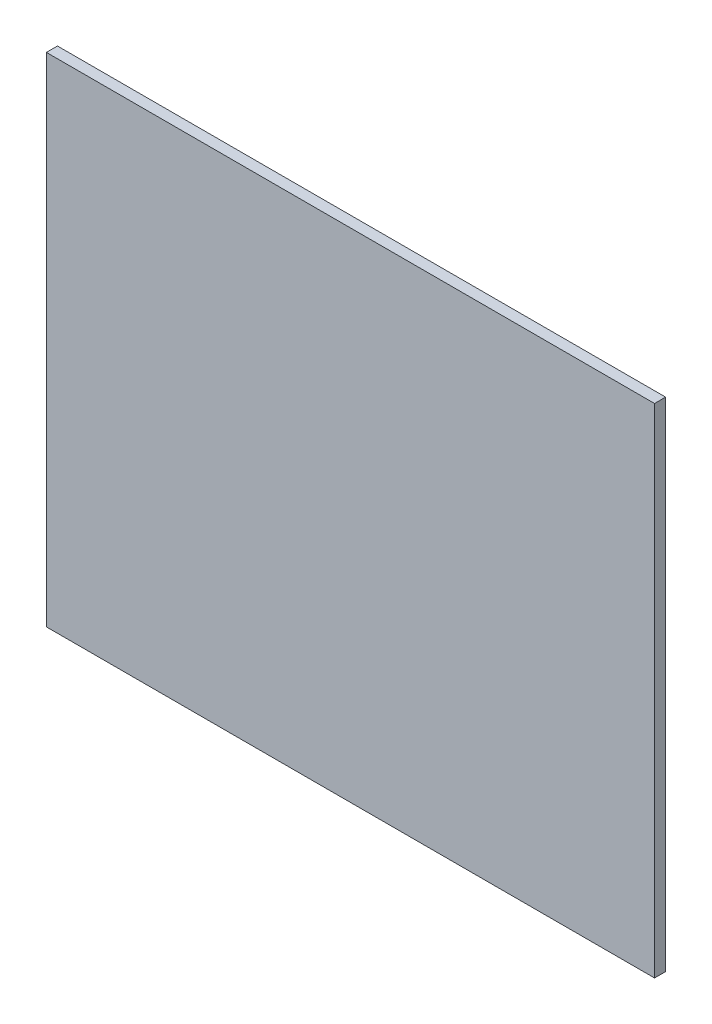
ISO-10303-21;
HEADER;
FILE_DESCRIPTION(('STEP AP214'),'2;1');
FILE_NAME('part.step','',(''),(''),'','','');
FILE_SCHEMA(('AUTOMOTIVE_DESIGN { 1 0 10303 214 1 1 1 1 }'));
ENDSEC;
DATA;
#1=APPLICATION_CONTEXT('core data for automotive mechanical design processes');
#2=APPLICATION_PROTOCOL_DEFINITION('international standard','automotive_design',2000,#1);
#3=PRODUCT_CONTEXT('',#1,'mechanical');
#4=PRODUCT('Part','Part','',(#3));
#5=PRODUCT_RELATED_PRODUCT_CATEGORY('part','',(#4));
#6=PRODUCT_DEFINITION_FORMATION('','',#4);
#7=PRODUCT_DEFINITION_CONTEXT('part definition',#1,'design');
#8=PRODUCT_DEFINITION('design','',#6,#7);
#9=PRODUCT_DEFINITION_SHAPE('','',#8);
#10=(LENGTH_UNIT() NAMED_UNIT(*) SI_UNIT(.MILLI.,.METRE.));
#11=(NAMED_UNIT(*) PLANE_ANGLE_UNIT() SI_UNIT($,.RADIAN.));
#12=(NAMED_UNIT(*) SI_UNIT($,.STERADIAN.) SOLID_ANGLE_UNIT());
#13=UNCERTAINTY_MEASURE_WITH_UNIT(LENGTH_MEASURE(1.E-05),#10,'distance_accuracy_value','');
#14=(GEOMETRIC_REPRESENTATION_CONTEXT(3) GLOBAL_UNCERTAINTY_ASSIGNED_CONTEXT((#13)) GLOBAL_UNIT_ASSIGNED_CONTEXT((#10,
#11,#12)) REPRESENTATION_CONTEXT('',''));
#15=CARTESIAN_POINT('',(0.,0.,0.));
#16=DIRECTION('',(0.,0.,1.));
#17=DIRECTION('',(1.,0.,0.));
#18=AXIS2_PLACEMENT_3D('',#15,#16,#17);
#19=CARTESIAN_POINT('',(27.5,-22.5,1.));
#20=DIRECTION('',(-1.,0.,0.));
#21=DIRECTION('',(0.,0.,1.));
#22=AXIS2_PLACEMENT_3D('',#19,#20,#21);
#23=PLANE('',#22);
#24=DIRECTION('',(0.,1.,0.));
#25=VECTOR('',#24,1.);
#26=CARTESIAN_POINT('',(27.5,-22.5,0.));
#27=LINE('',#26,#25);
#28=CARTESIAN_POINT('',(27.5,-22.5,0.));
#29=VERTEX_POINT('',#28);
#30=CARTESIAN_POINT('',(27.5,22.5,0.));
#31=VERTEX_POINT('',#30);
#32=EDGE_CURVE('E96',#29,#31,#27,.T.);
#33=ORIENTED_EDGE('',*,*,#32,.T.);
#34=DIRECTION('',(0.,0.,-1.));
#35=VECTOR('',#34,1.);
#36=CARTESIAN_POINT('',(27.5,22.5,1.));
#37=LINE('',#36,#35);
#38=CARTESIAN_POINT('',(27.5,22.5,1.));
#39=VERTEX_POINT('',#38);
#40=EDGE_CURVE('E11',#39,#31,#37,.T.);
#41=ORIENTED_EDGE('',*,*,#40,.F.);
#42=DIRECTION('',(0.,1.,0.));
#43=VECTOR('',#42,1.);
#44=CARTESIAN_POINT('',(27.5,-22.5,1.));
#45=LINE('',#44,#43);
#46=CARTESIAN_POINT('',(27.5,-22.5,1.));
#47=VERTEX_POINT('',#46);
#48=EDGE_CURVE('E84',#47,#39,#45,.T.);
#49=ORIENTED_EDGE('',*,*,#48,.F.);
#50=DIRECTION('',(0.,0.,-1.));
#51=VECTOR('',#50,1.);
#52=CARTESIAN_POINT('',(27.5,-22.5,1.));
#53=LINE('',#52,#51);
#54=EDGE_CURVE('E92',#47,#29,#53,.T.);
#55=ORIENTED_EDGE('',*,*,#54,.T.);
#56=EDGE_LOOP('',(#33,#41,#49,#55));
#57=FACE_BOUND('',#56,.T.);
#58=ADVANCED_FACE('F33',(#57),#23,.F.);
#59=CARTESIAN_POINT('',(-27.5,22.5,1.));
#60=DIRECTION('',(0.,-1.,0.));
#61=DIRECTION('',(0.,0.,-1.));
#62=AXIS2_PLACEMENT_3D('',#59,#60,#61);
#63=PLANE('',#62);
#64=DIRECTION('',(-1.,0.,0.));
#65=VECTOR('',#64,1.);
#66=CARTESIAN_POINT('',(-27.5,22.5,0.));
#67=LINE('',#66,#65);
#68=CARTESIAN_POINT('',(-27.5,22.5,0.));
#69=VERTEX_POINT('',#68);
#70=EDGE_CURVE('E88',#31,#69,#67,.T.);
#71=ORIENTED_EDGE('',*,*,#70,.T.);
#72=DIRECTION('',(0.,0.,-1.));
#73=VECTOR('',#72,1.);
#74=CARTESIAN_POINT('',(-27.5,22.5,1.));
#75=LINE('',#74,#73);
#76=CARTESIAN_POINT('',(-27.5,22.5,1.));
#77=VERTEX_POINT('',#76);
#78=EDGE_CURVE('E41',#77,#69,#75,.T.);
#79=ORIENTED_EDGE('',*,*,#78,.F.);
#80=DIRECTION('',(-1.,0.,0.));
#81=VECTOR('',#80,1.);
#82=CARTESIAN_POINT('',(-27.5,22.5,1.));
#83=LINE('',#82,#81);
#84=EDGE_CURVE('E79',#39,#77,#83,.T.);
#85=ORIENTED_EDGE('',*,*,#84,.F.);
#86=ORIENTED_EDGE('',*,*,#40,.T.);
#87=EDGE_LOOP('',(#71,#79,#85,#86));
#88=FACE_BOUND('',#87,.T.);
#89=ADVANCED_FACE('F87',(#88),#63,.F.);
#90=CARTESIAN_POINT('',(-27.5,-22.5,1.));
#91=DIRECTION('',(1.,0.,0.));
#92=DIRECTION('',(0.,0.,-1.));
#93=AXIS2_PLACEMENT_3D('',#90,#91,#92);
#94=PLANE('',#93);
#95=DIRECTION('',(0.,-1.,0.));
#96=VECTOR('',#95,1.);
#97=CARTESIAN_POINT('',(-27.5,-22.5,0.));
#98=LINE('',#97,#96);
#99=CARTESIAN_POINT('',(-27.5,-22.5,0.));
#100=VERTEX_POINT('',#99);
#101=EDGE_CURVE('E66',#69,#100,#98,.T.);
#102=ORIENTED_EDGE('',*,*,#101,.T.);
#103=DIRECTION('',(0.,0.,-1.));
#104=VECTOR('',#103,1.);
#105=CARTESIAN_POINT('',(-27.5,-22.5,1.));
#106=LINE('',#105,#104);
#107=CARTESIAN_POINT('',(-27.5,-22.5,1.));
#108=VERTEX_POINT('',#107);
#109=EDGE_CURVE('E89',#108,#100,#106,.T.);
#110=ORIENTED_EDGE('',*,*,#109,.F.);
#111=DIRECTION('',(0.,-1.,0.));
#112=VECTOR('',#111,1.);
#113=CARTESIAN_POINT('',(-27.5,-22.5,1.));
#114=LINE('',#113,#112);
#115=EDGE_CURVE('E82',#77,#108,#114,.T.);
#116=ORIENTED_EDGE('',*,*,#115,.F.);
#117=ORIENTED_EDGE('',*,*,#78,.T.);
#118=EDGE_LOOP('',(#102,#110,#116,#117));
#119=FACE_BOUND('',#118,.T.);
#120=ADVANCED_FACE('F90',(#119),#94,.F.);
#121=CARTESIAN_POINT('',(-27.5,-22.5,1.));
#122=DIRECTION('',(0.,1.,0.));
#123=DIRECTION('',(0.,0.,1.));
#124=AXIS2_PLACEMENT_3D('',#121,#122,#123);
#125=PLANE('',#124);
#126=DIRECTION('',(1.,0.,0.));
#127=VECTOR('',#126,1.);
#128=CARTESIAN_POINT('',(-27.5,-22.5,0.));
#129=LINE('',#128,#127);
#130=EDGE_CURVE('E72',#100,#29,#129,.T.);
#131=ORIENTED_EDGE('',*,*,#130,.T.);
#132=ORIENTED_EDGE('',*,*,#54,.F.);
#133=DIRECTION('',(1.,0.,0.));
#134=VECTOR('',#133,1.);
#135=CARTESIAN_POINT('',(-27.5,-22.5,1.));
#136=LINE('',#135,#134);
#137=EDGE_CURVE('E49',#108,#47,#136,.T.);
#138=ORIENTED_EDGE('',*,*,#137,.F.);
#139=ORIENTED_EDGE('',*,*,#109,.T.);
#140=EDGE_LOOP('',(#131,#132,#138,#139));
#141=FACE_BOUND('',#140,.T.);
#142=ADVANCED_FACE('F103',(#141),#125,.F.);
#143=CARTESIAN_POINT('',(0.,0.,1.));
#144=DIRECTION('',(0.,0.,-1.));
#145=DIRECTION('',(-1.,0.,0.));
#146=AXIS2_PLACEMENT_3D('',#143,#144,#145);
#147=PLANE('',#146);
#148=ORIENTED_EDGE('',*,*,#48,.T.);
#149=ORIENTED_EDGE('',*,*,#84,.T.);
#150=ORIENTED_EDGE('',*,*,#115,.T.);
#151=ORIENTED_EDGE('',*,*,#137,.T.);
#152=EDGE_LOOP('',(#148,#149,#150,#151));
#153=FACE_BOUND('',#152,.T.);
#154=ADVANCED_FACE('F80',(#153),#147,.F.);
#155=CARTESIAN_POINT('',(0.,0.,0.));
#156=DIRECTION('',(0.,0.,-1.));
#157=DIRECTION('',(-1.,0.,0.));
#158=AXIS2_PLACEMENT_3D('',#155,#156,#157);
#159=PLANE('',#158);
#160=ORIENTED_EDGE('',*,*,#32,.F.);
#161=ORIENTED_EDGE('',*,*,#130,.F.);
#162=ORIENTED_EDGE('',*,*,#101,.F.);
#163=ORIENTED_EDGE('',*,*,#70,.F.);
#164=EDGE_LOOP('',(#160,#161,#162,#163));
#165=FACE_BOUND('',#164,.T.);
#166=ADVANCED_FACE('F106',(#165),#159,.T.);
#167=CLOSED_SHELL('',(#58,#89,#120,#142,#154,#166));
#168=MANIFOLD_SOLID_BREP('B2',#167);
#169=ADVANCED_BREP_SHAPE_REPRESENTATION('',(#18,#168),#14);
#170=SHAPE_DEFINITION_REPRESENTATION(#9,#169);
ENDSEC;
END-ISO-10303-21;
